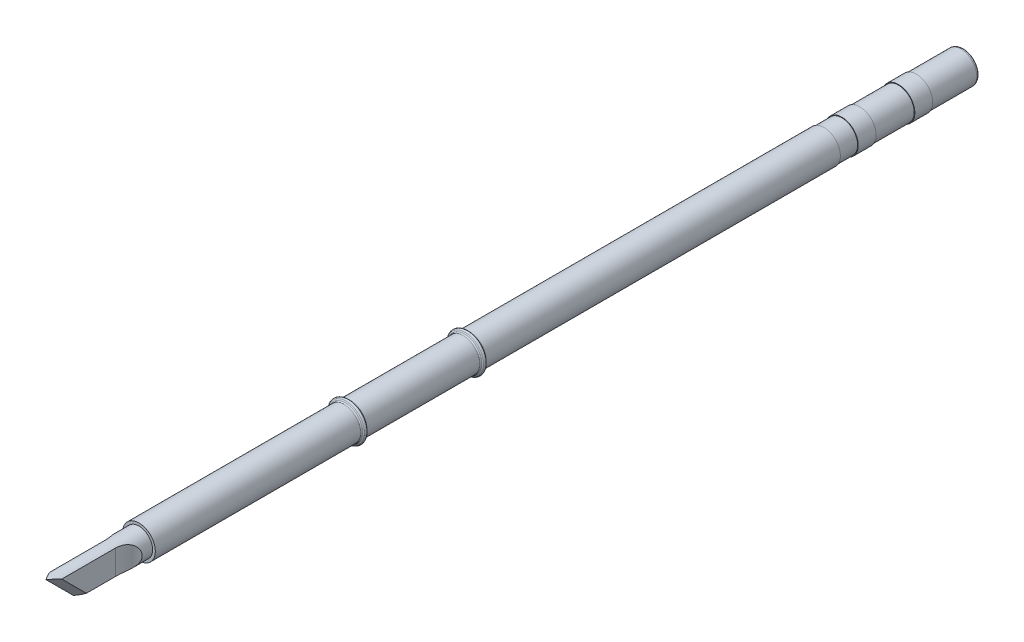
ISO-10303-21;
HEADER;
FILE_DESCRIPTION(('STEP AP214'),'2;1');
FILE_NAME('part.step','',(''),(''),'','','');
FILE_SCHEMA(('AUTOMOTIVE_DESIGN { 1 0 10303 214 1 1 1 1 }'));
ENDSEC;
DATA;
#1=APPLICATION_CONTEXT('core data for automotive mechanical design processes');
#2=APPLICATION_PROTOCOL_DEFINITION('international standard','automotive_design',2000,#1);
#3=PRODUCT_CONTEXT('',#1,'mechanical');
#4=PRODUCT('Part','Part','',(#3));
#5=PRODUCT_RELATED_PRODUCT_CATEGORY('part','',(#4));
#6=PRODUCT_DEFINITION_FORMATION('','',#4);
#7=PRODUCT_DEFINITION_CONTEXT('part definition',#1,'design');
#8=PRODUCT_DEFINITION('design','',#6,#7);
#9=PRODUCT_DEFINITION_SHAPE('','',#8);
#10=(LENGTH_UNIT() NAMED_UNIT(*) SI_UNIT(.MILLI.,.METRE.));
#11=(NAMED_UNIT(*) PLANE_ANGLE_UNIT() SI_UNIT($,.RADIAN.));
#12=(NAMED_UNIT(*) SI_UNIT($,.STERADIAN.) SOLID_ANGLE_UNIT());
#13=UNCERTAINTY_MEASURE_WITH_UNIT(LENGTH_MEASURE(1.E-05),#10,'distance_accuracy_value','');
#14=(GEOMETRIC_REPRESENTATION_CONTEXT(3) GLOBAL_UNCERTAINTY_ASSIGNED_CONTEXT((#13)) GLOBAL_UNIT_ASSIGNED_CONTEXT((#10,
#11,#12)) REPRESENTATION_CONTEXT('',''));
#15=CARTESIAN_POINT('',(0.,0.,0.));
#16=DIRECTION('',(0.,0.,1.));
#17=DIRECTION('',(1.,0.,0.));
#18=AXIS2_PLACEMENT_3D('',#15,#16,#17);
#19=CARTESIAN_POINT('',(0.,0.,-0.545183370351595));
#20=DIRECTION('',(0.,0.,-1.));
#21=DIRECTION('',(-1.,0.,0.));
#22=AXIS2_PLACEMENT_3D('',#19,#20,#21);
#23=TOROIDAL_SURFACE('',#22,3.,0.25);
#24=CARTESIAN_POINT('',(0.,0.,-0.545183370351596));
#25=DIRECTION('',(0.,0.,-1.));
#26=DIRECTION('',(-1.,0.,0.));
#27=AXIS2_PLACEMENT_3D('',#24,#25,#26);
#28=CIRCLE('',#27,2.75);
#29=CARTESIAN_POINT('',(-2.75,0.,-0.545183370351594));
#30=VERTEX_POINT('',#29);
#31=EDGE_CURVE('E216',#30,#30,#28,.T.);
#32=ORIENTED_EDGE('',*,*,#31,.F.);
#33=EDGE_LOOP('',(#32));
#34=FACE_BOUND('',#33,.T.);
#35=CARTESIAN_POINT('',(0.,0.,-0.328046378891428));
#36=DIRECTION('',(0.,0.,-1.));
#37=DIRECTION('',(-1.,0.,0.));
#38=AXIS2_PLACEMENT_3D('',#35,#36,#37);
#39=CIRCLE('',#38,2.87609872099277);
#40=CARTESIAN_POINT('',(-2.87609872099277,0.,-0.328046378891428));
#41=VERTEX_POINT('',#40);
#42=EDGE_CURVE('E116',#41,#41,#39,.T.);
#43=ORIENTED_EDGE('',*,*,#42,.T.);
#44=EDGE_LOOP('',(#43));
#45=FACE_BOUND('',#44,.T.);
#46=ADVANCED_FACE('F16',(#34,#45),#23,.F.);
#47=CARTESIAN_POINT('',(0.,0.,0.545183370351595));
#48=DIRECTION('',(0.,0.,-1.));
#49=DIRECTION('',(-1.,0.,0.));
#50=AXIS2_PLACEMENT_3D('',#47,#48,#49);
#51=TOROIDAL_SURFACE('',#50,3.,0.25);
#52=CARTESIAN_POINT('',(0.,0.,0.545183370351594));
#53=DIRECTION('',(0.,0.,-1.));
#54=DIRECTION('',(-1.,0.,0.));
#55=AXIS2_PLACEMENT_3D('',#52,#53,#54);
#56=CIRCLE('',#55,2.75);
#57=CARTESIAN_POINT('',(-2.75,0.,0.545183370351594));
#58=VERTEX_POINT('',#57);
#59=EDGE_CURVE('E210',#58,#58,#56,.T.);
#60=ORIENTED_EDGE('',*,*,#59,.T.);
#61=EDGE_LOOP('',(#60));
#62=FACE_BOUND('',#61,.T.);
#63=CARTESIAN_POINT('',(0.,0.,0.328046378891427));
#64=DIRECTION('',(0.,0.,-1.));
#65=DIRECTION('',(-1.,0.,0.));
#66=AXIS2_PLACEMENT_3D('',#63,#64,#65);
#67=CIRCLE('',#66,2.87609872099277);
#68=CARTESIAN_POINT('',(-2.87609872099277,0.,0.328046378891427));
#69=VERTEX_POINT('',#68);
#70=EDGE_CURVE('E268',#69,#69,#67,.T.);
#71=ORIENTED_EDGE('',*,*,#70,.F.);
#72=EDGE_LOOP('',(#71));
#73=FACE_BOUND('',#72,.T.);
#74=ADVANCED_FACE('F334',(#62,#73),#51,.F.);
#75=CARTESIAN_POINT('',(0.,0.,19.4548166296484));
#76=DIRECTION('',(0.,0.,-1.));
#77=DIRECTION('',(-1.,0.,0.));
#78=AXIS2_PLACEMENT_3D('',#75,#76,#77);
#79=TOROIDAL_SURFACE('',#78,3.,0.25);
#80=CARTESIAN_POINT('',(0.,0.,19.4548166296484));
#81=DIRECTION('',(0.,0.,-1.));
#82=DIRECTION('',(-1.,0.,0.));
#83=AXIS2_PLACEMENT_3D('',#80,#81,#82);
#84=CIRCLE('',#83,2.75);
#85=CARTESIAN_POINT('',(-2.75,0.,19.4548166296484));
#86=VERTEX_POINT('',#85);
#87=EDGE_CURVE('E214',#86,#86,#84,.T.);
#88=ORIENTED_EDGE('',*,*,#87,.F.);
#89=EDGE_LOOP('',(#88));
#90=FACE_BOUND('',#89,.T.);
#91=CARTESIAN_POINT('',(0.,0.,19.6719536211086));
#92=DIRECTION('',(0.,0.,-1.));
#93=DIRECTION('',(-1.,0.,0.));
#94=AXIS2_PLACEMENT_3D('',#91,#92,#93);
#95=CIRCLE('',#94,2.87609872099277);
#96=CARTESIAN_POINT('',(-2.87609872099277,0.,19.6719536211086));
#97=VERTEX_POINT('',#96);
#98=EDGE_CURVE('E215',#97,#97,#95,.T.);
#99=ORIENTED_EDGE('',*,*,#98,.T.);
#100=EDGE_LOOP('',(#99));
#101=FACE_BOUND('',#100,.T.);
#102=ADVANCED_FACE('F340',(#90,#101),#79,.F.);
#103=CARTESIAN_POINT('',(0.,0.,20.5451833703516));
#104=DIRECTION('',(0.,0.,-1.));
#105=DIRECTION('',(-1.,0.,0.));
#106=AXIS2_PLACEMENT_3D('',#103,#104,#105);
#107=TOROIDAL_SURFACE('',#106,3.,0.25);
#108=CARTESIAN_POINT('',(0.,0.,20.5451833703516));
#109=DIRECTION('',(0.,0.,-1.));
#110=DIRECTION('',(-1.,0.,0.));
#111=AXIS2_PLACEMENT_3D('',#108,#109,#110);
#112=CIRCLE('',#111,2.75);
#113=CARTESIAN_POINT('',(-2.75,0.,20.5451833703516));
#114=VERTEX_POINT('',#113);
#115=EDGE_CURVE('E193',#114,#114,#112,.T.);
#116=ORIENTED_EDGE('',*,*,#115,.T.);
#117=EDGE_LOOP('',(#116));
#118=FACE_BOUND('',#117,.T.);
#119=CARTESIAN_POINT('',(0.,0.,20.3280463788914));
#120=DIRECTION('',(0.,0.,-1.));
#121=DIRECTION('',(-1.,0.,0.));
#122=AXIS2_PLACEMENT_3D('',#119,#120,#121);
#123=CIRCLE('',#122,2.87609872099277);
#124=CARTESIAN_POINT('',(-2.87609872099277,0.,20.3280463788914));
#125=VERTEX_POINT('',#124);
#126=EDGE_CURVE('E192',#125,#125,#123,.T.);
#127=ORIENTED_EDGE('',*,*,#126,.F.);
#128=EDGE_LOOP('',(#127));
#129=FACE_BOUND('',#128,.T.);
#130=ADVANCED_FACE('F364',(#118,#129),#107,.F.);
#131=CARTESIAN_POINT('',(0.,0.,0.));
#132=DIRECTION('',(0.,0.,-1.));
#133=DIRECTION('',(-1.,0.,0.));
#134=AXIS2_PLACEMENT_3D('',#131,#132,#133);
#135=TOROIDAL_SURFACE('',#134,2.94656614345883,0.25);
#136=CARTESIAN_POINT('',(0.,0.,0.217136991460167));
#137=DIRECTION('',(0.,0.,-1.));
#138=DIRECTION('',(-1.,0.,0.));
#139=AXIS2_PLACEMENT_3D('',#136,#137,#138);
#140=CIRCLE('',#139,3.07046742246606);
#141=CARTESIAN_POINT('',(-3.07046742246605,0.,0.217136991460167));
#142=VERTEX_POINT('',#141);
#143=EDGE_CURVE('E233',#142,#142,#140,.T.);
#144=ORIENTED_EDGE('',*,*,#143,.T.);
#145=EDGE_LOOP('',(#144));
#146=FACE_BOUND('',#145,.T.);
#147=CARTESIAN_POINT('',(0.,0.,-0.217136991460168));
#148=DIRECTION('',(0.,0.,-1.));
#149=DIRECTION('',(-1.,0.,0.));
#150=AXIS2_PLACEMENT_3D('',#147,#148,#149);
#151=CIRCLE('',#150,3.07046742246606);
#152=CARTESIAN_POINT('',(-3.07046742246605,0.,-0.217136991460169));
#153=VERTEX_POINT('',#152);
#154=EDGE_CURVE('E245',#153,#153,#151,.T.);
#155=ORIENTED_EDGE('',*,*,#154,.F.);
#156=EDGE_LOOP('',(#155));
#157=FACE_BOUND('',#156,.T.);
#158=ADVANCED_FACE('F414',(#146,#157),#135,.T.);
#159=CARTESIAN_POINT('',(0.,0.,20.));
#160=DIRECTION('',(0.,0.,-1.));
#161=DIRECTION('',(-1.,0.,0.));
#162=AXIS2_PLACEMENT_3D('',#159,#160,#161);
#163=TOROIDAL_SURFACE('',#162,2.94656614345883,0.25);
#164=CARTESIAN_POINT('',(0.,0.,20.2171369914602));
#165=DIRECTION('',(0.,0.,-1.));
#166=DIRECTION('',(-1.,0.,0.));
#167=AXIS2_PLACEMENT_3D('',#164,#165,#166);
#168=CIRCLE('',#167,3.07046742246605);
#169=CARTESIAN_POINT('',(-3.07046742246606,0.,20.2171369914602));
#170=VERTEX_POINT('',#169);
#171=EDGE_CURVE('E187',#170,#170,#168,.T.);
#172=ORIENTED_EDGE('',*,*,#171,.T.);
#173=EDGE_LOOP('',(#172));
#174=FACE_BOUND('',#173,.T.);
#175=CARTESIAN_POINT('',(0.,0.,19.7828630085398));
#176=DIRECTION('',(0.,0.,-1.));
#177=DIRECTION('',(-1.,0.,0.));
#178=AXIS2_PLACEMENT_3D('',#175,#176,#177);
#179=CIRCLE('',#178,3.07046742246605);
#180=CARTESIAN_POINT('',(-3.07046742246606,0.,19.7828630085398));
#181=VERTEX_POINT('',#180);
#182=EDGE_CURVE('E200',#181,#181,#179,.T.);
#183=ORIENTED_EDGE('',*,*,#182,.F.);
#184=EDGE_LOOP('',(#183));
#185=FACE_BOUND('',#184,.T.);
#186=ADVANCED_FACE('F188',(#174,#185),#163,.T.);
#187=CARTESIAN_POINT('',(0.,0.,-83.));
#188=DIRECTION('',(0.,0.,-1.));
#189=DIRECTION('',(-1.,0.,0.));
#190=AXIS2_PLACEMENT_3D('',#187,#188,#189);
#191=TOROIDAL_SURFACE('',#190,2.15,0.5);
#192=CARTESIAN_POINT('',(0.,0.,-83.5));
#193=DIRECTION('',(0.,0.,-1.));
#194=DIRECTION('',(-1.,0.,0.));
#195=AXIS2_PLACEMENT_3D('',#192,#193,#194);
#196=CIRCLE('',#195,2.15);
#197=CARTESIAN_POINT('',(-2.15,0.,-83.5));
#198=VERTEX_POINT('',#197);
#199=EDGE_CURVE('E27',#198,#198,#196,.T.);
#200=ORIENTED_EDGE('',*,*,#199,.F.);
#201=EDGE_LOOP('',(#200));
#202=FACE_BOUND('',#201,.T.);
#203=CARTESIAN_POINT('',(0.,0.,-83.));
#204=DIRECTION('',(0.,0.,-1.));
#205=DIRECTION('',(-1.,0.,0.));
#206=AXIS2_PLACEMENT_3D('',#203,#204,#205);
#207=CIRCLE('',#206,2.65);
#208=CARTESIAN_POINT('',(-2.65,0.,-83.));
#209=VERTEX_POINT('',#208);
#210=EDGE_CURVE('E223',#209,#209,#207,.T.);
#211=ORIENTED_EDGE('',*,*,#210,.T.);
#212=EDGE_LOOP('',(#211));
#213=FACE_BOUND('',#212,.T.);
#214=ADVANCED_FACE('F313',(#202,#213),#191,.T.);
#215=CARTESIAN_POINT('',(-1.,-4.19255186128045,62.6932345763465));
#216=DIRECTION('',(0.707106781186547,0.5,-0.5));
#217=DIRECTION('',(0.,-0.707106781186549,-0.707106781186546));
#218=AXIS2_PLACEMENT_3D('',#215,#216,#217);
#219=PLANE('',#218);
#220=DIRECTION('',(0.,0.707106781186549,0.707106781186546));
#221=VECTOR('',#220,1.);
#222=CARTESIAN_POINT('',(-1.,-2.0712315177208,64.8145549199061));
#223=LINE('',#222,#221);
#224=CARTESIAN_POINT('',(-1.,-2.0712315177208,64.8145549199061));
#225=VERTEX_POINT('',#224);
#226=CARTESIAN_POINT('',(-1.,2.07123151772079,68.9570179553477));
#227=VERTEX_POINT('',#226);
#228=EDGE_CURVE('E229',#225,#227,#223,.T.);
#229=ORIENTED_EDGE('',*,*,#228,.F.);
#230=CARTESIAN_POINT('',(-1.,-2.0712315177208,64.8145549199061));
#231=CARTESIAN_POINT('',(-0.686808648763807,-2.2224417269884,65.1062641671747));
#232=CARTESIAN_POINT('',(-0.347783481315479,-2.3,65.5081598839543));
#233=CARTESIAN_POINT('',(0.,-2.3,66.));
#234=(BOUNDED_CURVE() B_SPLINE_CURVE(3,(#230,#231,#232,#233),.UNSPECIFIED.,.F.,
.F.) B_SPLINE_CURVE_WITH_KNOTS((4,4),(-1.,0.),
.UNSPECIFIED.) CURVE() GEOMETRIC_REPRESENTATION_ITEM() RATIONAL_B_SPLINE_CURVE((1.,
0.983211175271049,0.983211175271049,1.)) REPRESENTATION_ITEM(''));
#235=CARTESIAN_POINT('',(0.,-2.3,66.));
#236=VERTEX_POINT('',#235);
#237=EDGE_CURVE('E298',#225,#236,#234,.T.);
#238=ORIENTED_EDGE('',*,*,#237,.T.);
#239=DIRECTION('',(0.,-0.707106781186548,-0.707106781186547));
#240=VECTOR('',#239,1.);
#241=CARTESIAN_POINT('',(0.,2.3,70.6));
#242=LINE('',#241,#240);
#243=CARTESIAN_POINT('',(0.,2.3,70.6));
#244=VERTEX_POINT('',#243);
#245=EDGE_CURVE('E11',#244,#236,#242,.T.);
#246=ORIENTED_EDGE('',*,*,#245,.F.);
#247=CARTESIAN_POINT('',(0.,2.3,70.6));
#248=CARTESIAN_POINT('',(-0.347783481315481,2.3,70.1081598839543));
#249=CARTESIAN_POINT('',(-0.686808648763809,2.22244172698839,69.5511476211515));
#250=CARTESIAN_POINT('',(-1.,2.07123151772079,68.9570179553477));
#251=(BOUNDED_CURVE() B_SPLINE_CURVE(3,(#247,#248,#249,#250),.UNSPECIFIED.,.F.,
.F.) B_SPLINE_CURVE_WITH_KNOTS((4,4),(-1.,0.),
.UNSPECIFIED.) CURVE() GEOMETRIC_REPRESENTATION_ITEM() RATIONAL_B_SPLINE_CURVE((1.,
0.983211175271049,0.983211175271049,1.)) REPRESENTATION_ITEM(''));
#252=EDGE_CURVE('E239',#244,#227,#251,.T.);
#253=ORIENTED_EDGE('',*,*,#252,.T.);
#254=EDGE_LOOP('',(#229,#238,#246,#253));
#255=FACE_BOUND('',#254,.T.);
#256=ADVANCED_FACE('F426',(#255),#219,.F.);
#257=CARTESIAN_POINT('',(0.999999999999988,5.60676542365356,72.4925518612805));
#258=DIRECTION('',(-0.707106781186545,0.5,-0.5));
#259=DIRECTION('',(-0.577350269189629,0.,0.816496580927724));
#260=AXIS2_PLACEMENT_3D('',#257,#258,#259);
#261=PLANE('',#260);
#262=DIRECTION('',(0.,-0.707106781186547,-0.707106781186549));
#263=VECTOR('',#262,1.);
#264=CARTESIAN_POINT('',(0.999999999999988,2.07123151772079,68.9570179553477));
#265=LINE('',#264,#263);
#266=CARTESIAN_POINT('',(0.999999999999988,2.07123151772079,68.9570179553477));
#267=VERTEX_POINT('',#266);
#268=CARTESIAN_POINT('',(0.999999999999988,-2.0712315177208,64.8145549199061));
#269=VERTEX_POINT('',#268);
#270=EDGE_CURVE('E290',#267,#269,#265,.T.);
#271=ORIENTED_EDGE('',*,*,#270,.F.);
#272=CARTESIAN_POINT('',(0.999999999999989,2.07123151772079,68.9570179553477));
#273=CARTESIAN_POINT('',(0.686808648763787,2.22244172698839,69.5511476211515));
#274=CARTESIAN_POINT('',(0.347783481315461,2.3,70.1081598839543));
#275=CARTESIAN_POINT('',(0.,2.3,70.6));
#276=(BOUNDED_CURVE() B_SPLINE_CURVE(3,(#272,#273,#274,#275),.UNSPECIFIED.,.F.,
.F.) B_SPLINE_CURVE_WITH_KNOTS((4,4),(0.,1.),
.UNSPECIFIED.) CURVE() GEOMETRIC_REPRESENTATION_ITEM() RATIONAL_B_SPLINE_CURVE((1.,
0.983211175271049,0.983211175271049,1.)) REPRESENTATION_ITEM(''));
#277=EDGE_CURVE('E234',#267,#244,#276,.T.);
#278=ORIENTED_EDGE('',*,*,#277,.T.);
#279=ORIENTED_EDGE('',*,*,#245,.T.);
#280=CARTESIAN_POINT('',(0.,-2.3,66.));
#281=CARTESIAN_POINT('',(0.347783481315458,-2.3,65.5081598839543));
#282=CARTESIAN_POINT('',(0.686808648763784,-2.2224417269884,65.1062641671747));
#283=CARTESIAN_POINT('',(0.999999999999986,-2.0712315177208,64.8145549199061));
#284=(BOUNDED_CURVE() B_SPLINE_CURVE(3,(#280,#281,#282,#283),.UNSPECIFIED.,.F.,
.F.) B_SPLINE_CURVE_WITH_KNOTS((4,4),(0.,1.),
.UNSPECIFIED.) CURVE() GEOMETRIC_REPRESENTATION_ITEM() RATIONAL_B_SPLINE_CURVE((1.,
0.983211175271049,0.983211175271049,1.)) REPRESENTATION_ITEM(''));
#285=EDGE_CURVE('E440',#236,#269,#284,.T.);
#286=ORIENTED_EDGE('',*,*,#285,.T.);
#287=EDGE_LOOP('',(#271,#278,#279,#286));
#288=FACE_BOUND('',#287,.T.);
#289=ADVANCED_FACE('F329',(#288),#261,.F.);
#290=CARTESIAN_POINT('',(0.,0.,-83.5));
#291=DIRECTION('',(0.,0.,-1.));
#292=DIRECTION('',(0.,-1.,0.));
#293=AXIS2_PLACEMENT_3D('',#290,#291,#292);
#294=PLANE('',#293);
#295=ORIENTED_EDGE('',*,*,#199,.T.);
#296=EDGE_LOOP('',(#295));
#297=FACE_BOUND('',#296,.T.);
#298=ADVANCED_FACE('F318',(#297),#294,.T.);
#299=CARTESIAN_POINT('',(0.,0.,-75.5));
#300=DIRECTION('',(0.,0.,-1.));
#301=DIRECTION('',(-1.,0.,0.));
#302=AXIS2_PLACEMENT_3D('',#299,#300,#301);
#303=CYLINDRICAL_SURFACE('',#302,2.65);
#304=CARTESIAN_POINT('',(0.,0.,-75.5));
#305=DIRECTION('',(0.,0.,-1.));
#306=DIRECTION('',(-1.,0.,0.));
#307=AXIS2_PLACEMENT_3D('',#304,#305,#306);
#308=CIRCLE('',#307,2.65);
#309=CARTESIAN_POINT('',(-2.65,0.,-75.5));
#310=VERTEX_POINT('',#309);
#311=EDGE_CURVE('E220',#310,#310,#308,.T.);
#312=ORIENTED_EDGE('',*,*,#311,.T.);
#313=EDGE_LOOP('',(#312));
#314=FACE_BOUND('',#313,.T.);
#315=ORIENTED_EDGE('',*,*,#210,.F.);
#316=EDGE_LOOP('',(#315));
#317=FACE_BOUND('',#316,.T.);
#318=ADVANCED_FACE('F315',(#314,#317),#303,.T.);
#319=CARTESIAN_POINT('',(0.,0.,-75.5));
#320=DIRECTION('',(0.,0.,-1.));
#321=DIRECTION('',(0.,-1.,0.));
#322=AXIS2_PLACEMENT_3D('',#319,#320,#321);
#323=PLANE('',#322);
#324=ORIENTED_EDGE('',*,*,#311,.F.);
#325=EDGE_LOOP('',(#324));
#326=FACE_BOUND('',#325,.T.);
#327=CARTESIAN_POINT('',(0.,0.,-75.5));
#328=DIRECTION('',(0.,0.,-1.));
#329=DIRECTION('',(-1.,0.,0.));
#330=AXIS2_PLACEMENT_3D('',#327,#328,#329);
#331=CIRCLE('',#330,2.75);
#332=CARTESIAN_POINT('',(-2.75,0.,-75.5));
#333=VERTEX_POINT('',#332);
#334=EDGE_CURVE('E224',#333,#333,#331,.T.);
#335=ORIENTED_EDGE('',*,*,#334,.T.);
#336=EDGE_LOOP('',(#335));
#337=FACE_BOUND('',#336,.T.);
#338=ADVANCED_FACE('F317',(#326,#337),#323,.T.);
#339=CARTESIAN_POINT('',(0.,0.,-72.5));
#340=DIRECTION('',(0.,0.,-1.));
#341=DIRECTION('',(-1.,0.,0.));
#342=AXIS2_PLACEMENT_3D('',#339,#340,#341);
#343=CYLINDRICAL_SURFACE('',#342,2.75);
#344=CARTESIAN_POINT('',(0.,0.,-72.5));
#345=DIRECTION('',(0.,0.,-1.));
#346=DIRECTION('',(-1.,0.,0.));
#347=AXIS2_PLACEMENT_3D('',#344,#345,#346);
#348=CIRCLE('',#347,2.75);
#349=CARTESIAN_POINT('',(-2.75,0.,-72.5));
#350=VERTEX_POINT('',#349);
#351=EDGE_CURVE('E259',#350,#350,#348,.T.);
#352=ORIENTED_EDGE('',*,*,#351,.T.);
#353=EDGE_LOOP('',(#352));
#354=FACE_BOUND('',#353,.T.);
#355=ORIENTED_EDGE('',*,*,#334,.F.);
#356=EDGE_LOOP('',(#355));
#357=FACE_BOUND('',#356,.T.);
#358=ADVANCED_FACE('F326',(#354,#357),#343,.T.);
#359=CARTESIAN_POINT('',(0.,0.,-72.5));
#360=DIRECTION('',(0.,0.,1.));
#361=DIRECTION('',(1.,0.,0.));
#362=AXIS2_PLACEMENT_3D('',#359,#360,#361);
#363=PLANE('',#362);
#364=CARTESIAN_POINT('',(0.,0.,-72.5));
#365=DIRECTION('',(0.,0.,-1.));
#366=DIRECTION('',(-1.,0.,0.));
#367=AXIS2_PLACEMENT_3D('',#364,#365,#366);
#368=CIRCLE('',#367,2.65);
#369=CARTESIAN_POINT('',(-2.65,0.,-72.5));
#370=VERTEX_POINT('',#369);
#371=EDGE_CURVE('E256',#370,#370,#368,.T.);
#372=ORIENTED_EDGE('',*,*,#371,.T.);
#373=EDGE_LOOP('',(#372));
#374=FACE_BOUND('',#373,.T.);
#375=ORIENTED_EDGE('',*,*,#351,.F.);
#376=EDGE_LOOP('',(#375));
#377=FACE_BOUND('',#376,.T.);
#378=ADVANCED_FACE('F18',(#374,#377),#363,.T.);
#379=CARTESIAN_POINT('',(0.,0.,-66.));
#380=DIRECTION('',(0.,0.,-1.));
#381=DIRECTION('',(-1.,0.,0.));
#382=AXIS2_PLACEMENT_3D('',#379,#380,#381);
#383=CYLINDRICAL_SURFACE('',#382,2.65);
#384=CARTESIAN_POINT('',(0.,0.,-66.));
#385=DIRECTION('',(0.,0.,-1.));
#386=DIRECTION('',(-1.,0.,0.));
#387=AXIS2_PLACEMENT_3D('',#384,#385,#386);
#388=CIRCLE('',#387,2.65);
#389=CARTESIAN_POINT('',(-2.65,0.,-66.));
#390=VERTEX_POINT('',#389);
#391=EDGE_CURVE('E255',#390,#390,#388,.T.);
#392=ORIENTED_EDGE('',*,*,#391,.T.);
#393=EDGE_LOOP('',(#392));
#394=FACE_BOUND('',#393,.T.);
#395=ORIENTED_EDGE('',*,*,#371,.F.);
#396=EDGE_LOOP('',(#395));
#397=FACE_BOUND('',#396,.T.);
#398=ADVANCED_FACE('F369',(#394,#397),#383,.T.);
#399=CARTESIAN_POINT('',(0.,0.,-66.));
#400=DIRECTION('',(0.,0.,-1.));
#401=DIRECTION('',(0.,-1.,0.));
#402=AXIS2_PLACEMENT_3D('',#399,#400,#401);
#403=PLANE('',#402);
#404=ORIENTED_EDGE('',*,*,#391,.F.);
#405=EDGE_LOOP('',(#404));
#406=FACE_BOUND('',#405,.T.);
#407=CARTESIAN_POINT('',(0.,0.,-66.));
#408=DIRECTION('',(0.,0.,-1.));
#409=DIRECTION('',(-1.,0.,0.));
#410=AXIS2_PLACEMENT_3D('',#407,#408,#409);
#411=CIRCLE('',#410,2.75);
#412=CARTESIAN_POINT('',(-2.75,0.,-66.));
#413=VERTEX_POINT('',#412);
#414=EDGE_CURVE('E251',#413,#413,#411,.T.);
#415=ORIENTED_EDGE('',*,*,#414,.T.);
#416=EDGE_LOOP('',(#415));
#417=FACE_BOUND('',#416,.T.);
#418=ADVANCED_FACE('F355',(#406,#417),#403,.T.);
#419=CARTESIAN_POINT('',(0.,0.,-63.));
#420=DIRECTION('',(0.,0.,-1.));
#421=DIRECTION('',(-1.,0.,0.));
#422=AXIS2_PLACEMENT_3D('',#419,#420,#421);
#423=CYLINDRICAL_SURFACE('',#422,2.75);
#424=CARTESIAN_POINT('',(0.,0.,-63.));
#425=DIRECTION('',(0.,0.,-1.));
#426=DIRECTION('',(-1.,0.,0.));
#427=AXIS2_PLACEMENT_3D('',#424,#425,#426);
#428=CIRCLE('',#427,2.75);
#429=CARTESIAN_POINT('',(-2.75,0.,-63.));
#430=VERTEX_POINT('',#429);
#431=EDGE_CURVE('E20',#430,#430,#428,.T.);
#432=ORIENTED_EDGE('',*,*,#431,.T.);
#433=EDGE_LOOP('',(#432));
#434=FACE_BOUND('',#433,.T.);
#435=ORIENTED_EDGE('',*,*,#414,.F.);
#436=EDGE_LOOP('',(#435));
#437=FACE_BOUND('',#436,.T.);
#438=ADVANCED_FACE('F352',(#434,#437),#423,.T.);
#439=CARTESIAN_POINT('',(0.,0.,-63.));
#440=DIRECTION('',(0.,0.,1.));
#441=DIRECTION('',(1.,0.,0.));
#442=AXIS2_PLACEMENT_3D('',#439,#440,#441);
#443=PLANE('',#442);
#444=CARTESIAN_POINT('',(0.,0.,-63.));
#445=DIRECTION('',(0.,0.,-1.));
#446=DIRECTION('',(-1.,0.,0.));
#447=AXIS2_PLACEMENT_3D('',#444,#445,#446);
#448=CIRCLE('',#447,2.65);
#449=CARTESIAN_POINT('',(-2.65,0.,-63.));
#450=VERTEX_POINT('',#449);
#451=EDGE_CURVE('E273',#450,#450,#448,.T.);
#452=ORIENTED_EDGE('',*,*,#451,.T.);
#453=EDGE_LOOP('',(#452));
#454=FACE_BOUND('',#453,.T.);
#455=ORIENTED_EDGE('',*,*,#431,.F.);
#456=EDGE_LOOP('',(#455));
#457=FACE_BOUND('',#456,.T.);
#458=ADVANCED_FACE('F348',(#454,#457),#443,.T.);
#459=CARTESIAN_POINT('',(0.,0.,-60.));
#460=DIRECTION('',(0.,0.,-1.));
#461=DIRECTION('',(-1.,0.,0.));
#462=AXIS2_PLACEMENT_3D('',#459,#460,#461);
#463=CYLINDRICAL_SURFACE('',#462,2.65);
#464=CARTESIAN_POINT('',(0.,0.,-60.));
#465=DIRECTION('',(0.,0.,-1.));
#466=DIRECTION('',(-1.,0.,0.));
#467=AXIS2_PLACEMENT_3D('',#464,#465,#466);
#468=CIRCLE('',#467,2.65);
#469=CARTESIAN_POINT('',(-2.65,0.,-60.));
#470=VERTEX_POINT('',#469);
#471=EDGE_CURVE('E219',#470,#470,#468,.T.);
#472=ORIENTED_EDGE('',*,*,#471,.T.);
#473=EDGE_LOOP('',(#472));
#474=FACE_BOUND('',#473,.T.);
#475=ORIENTED_EDGE('',*,*,#451,.F.);
#476=EDGE_LOOP('',(#475));
#477=FACE_BOUND('',#476,.T.);
#478=ADVANCED_FACE('F351',(#474,#477),#463,.T.);
#479=CARTESIAN_POINT('',(0.,0.,-60.));
#480=DIRECTION('',(0.,0.,-1.));
#481=DIRECTION('',(0.,-1.,0.));
#482=AXIS2_PLACEMENT_3D('',#479,#480,#481);
#483=PLANE('',#482);
#484=ORIENTED_EDGE('',*,*,#471,.F.);
#485=EDGE_LOOP('',(#484));
#486=FACE_BOUND('',#485,.T.);
#487=CARTESIAN_POINT('',(0.,0.,-60.));
#488=DIRECTION('',(0.,0.,-1.));
#489=DIRECTION('',(-1.,0.,0.));
#490=AXIS2_PLACEMENT_3D('',#487,#488,#489);
#491=CIRCLE('',#490,2.75);
#492=CARTESIAN_POINT('',(-2.75,0.,-60.));
#493=VERTEX_POINT('',#492);
#494=EDGE_CURVE('E103',#493,#493,#491,.T.);
#495=ORIENTED_EDGE('',*,*,#494,.T.);
#496=EDGE_LOOP('',(#495));
#497=FACE_BOUND('',#496,.T.);
#498=ADVANCED_FACE('F379',(#486,#497),#483,.T.);
#499=CARTESIAN_POINT('',(0.,0.,-0.4));
#500=DIRECTION('',(0.,0.,-1.));
#501=DIRECTION('',(-1.,0.,0.));
#502=AXIS2_PLACEMENT_3D('',#499,#500,#501);
#503=CYLINDRICAL_SURFACE('',#502,2.75);
#504=ORIENTED_EDGE('',*,*,#31,.T.);
#505=EDGE_LOOP('',(#504));
#506=FACE_BOUND('',#505,.T.);
#507=ORIENTED_EDGE('',*,*,#494,.F.);
#508=EDGE_LOOP('',(#507));
#509=FACE_BOUND('',#508,.T.);
#510=ADVANCED_FACE('F385',(#506,#509),#503,.T.);
#511=CARTESIAN_POINT('',(0.,0.,-0.272591685175798));
#512=DIRECTION('',(0.,0.,1.));
#513=DIRECTION('',(1.,0.,0.));
#514=AXIS2_PLACEMENT_3D('',#511,#512,#513);
#515=CONICAL_SURFACE('',#514,2.97328307172941,1.05226493507737);
#516=ORIENTED_EDGE('',*,*,#42,.F.);
#517=EDGE_LOOP('',(#516));
#518=FACE_BOUND('',#517,.T.);
#519=ORIENTED_EDGE('',*,*,#154,.T.);
#520=EDGE_LOOP('',(#519));
#521=FACE_BOUND('',#520,.T.);
#522=ADVANCED_FACE('F387',(#518,#521),#515,.T.);
#523=CARTESIAN_POINT('',(0.,0.,0.272591685175797));
#524=DIRECTION('',(0.,0.,-1.));
#525=DIRECTION('',(-1.,0.,0.));
#526=AXIS2_PLACEMENT_3D('',#523,#524,#525);
#527=CONICAL_SURFACE('',#526,2.97328307172941,1.05226493507737);
#528=ORIENTED_EDGE('',*,*,#70,.T.);
#529=EDGE_LOOP('',(#528));
#530=FACE_BOUND('',#529,.T.);
#531=ORIENTED_EDGE('',*,*,#143,.F.);
#532=EDGE_LOOP('',(#531));
#533=FACE_BOUND('',#532,.T.);
#534=ADVANCED_FACE('F383',(#530,#533),#527,.T.);
#535=CARTESIAN_POINT('',(0.,0.,19.6));
#536=DIRECTION('',(0.,0.,-1.));
#537=DIRECTION('',(-1.,0.,0.));
#538=AXIS2_PLACEMENT_3D('',#535,#536,#537);
#539=CYLINDRICAL_SURFACE('',#538,2.75);
#540=ORIENTED_EDGE('',*,*,#87,.T.);
#541=EDGE_LOOP('',(#540));
#542=FACE_BOUND('',#541,.T.);
#543=ORIENTED_EDGE('',*,*,#59,.F.);
#544=EDGE_LOOP('',(#543));
#545=FACE_BOUND('',#544,.T.);
#546=ADVANCED_FACE('F381',(#542,#545),#539,.T.);
#547=CARTESIAN_POINT('',(0.,0.,19.7274083148242));
#548=DIRECTION('',(0.,0.,1.));
#549=DIRECTION('',(1.,0.,0.));
#550=AXIS2_PLACEMENT_3D('',#547,#548,#549);
#551=CONICAL_SURFACE('',#550,2.97328307172941,1.05226493507737);
#552=ORIENTED_EDGE('',*,*,#98,.F.);
#553=EDGE_LOOP('',(#552));
#554=FACE_BOUND('',#553,.T.);
#555=ORIENTED_EDGE('',*,*,#182,.T.);
#556=EDGE_LOOP('',(#555));
#557=FACE_BOUND('',#556,.T.);
#558=ADVANCED_FACE('F375',(#554,#557),#551,.T.);
#559=CARTESIAN_POINT('',(0.,0.,20.2725916851758));
#560=DIRECTION('',(0.,0.,-1.));
#561=DIRECTION('',(-1.,0.,0.));
#562=AXIS2_PLACEMENT_3D('',#559,#560,#561);
#563=CONICAL_SURFACE('',#562,2.97328307172941,1.05226493507737);
#564=ORIENTED_EDGE('',*,*,#126,.T.);
#565=EDGE_LOOP('',(#564));
#566=FACE_BOUND('',#565,.T.);
#567=ORIENTED_EDGE('',*,*,#171,.F.);
#568=EDGE_LOOP('',(#567));
#569=FACE_BOUND('',#568,.T.);
#570=ADVANCED_FACE('F371',(#566,#569),#563,.T.);
#571=CARTESIAN_POINT('',(0.,0.,55.));
#572=DIRECTION('',(0.,0.,-1.));
#573=DIRECTION('',(-1.,0.,0.));
#574=AXIS2_PLACEMENT_3D('',#571,#572,#573);
#575=CYLINDRICAL_SURFACE('',#574,2.75);
#576=CARTESIAN_POINT('',(0.,0.,55.));
#577=DIRECTION('',(0.,0.,-1.));
#578=DIRECTION('',(-1.,0.,0.));
#579=AXIS2_PLACEMENT_3D('',#576,#577,#578);
#580=CIRCLE('',#579,2.75);
#581=CARTESIAN_POINT('',(-2.75,0.,55.));
#582=VERTEX_POINT('',#581);
#583=EDGE_CURVE('E202',#582,#582,#580,.T.);
#584=ORIENTED_EDGE('',*,*,#583,.T.);
#585=EDGE_LOOP('',(#584));
#586=FACE_BOUND('',#585,.T.);
#587=ORIENTED_EDGE('',*,*,#115,.F.);
#588=EDGE_LOOP('',(#587));
#589=FACE_BOUND('',#588,.T.);
#590=ADVANCED_FACE('F374',(#586,#589),#575,.T.);
#591=CARTESIAN_POINT('',(0.,0.,55.));
#592=DIRECTION('',(0.,0.,1.));
#593=DIRECTION('',(1.,0.,0.));
#594=AXIS2_PLACEMENT_3D('',#591,#592,#593);
#595=PLANE('',#594);
#596=CARTESIAN_POINT('',(0.,0.,55.));
#597=DIRECTION('',(0.,0.,1.));
#598=DIRECTION('',(0.,1.,0.));
#599=AXIS2_PLACEMENT_3D('',#596,#597,#598);
#600=CIRCLE('',#599,2.3);
#601=CARTESIAN_POINT('',(0.,2.3,55.));
#602=VERTEX_POINT('',#601);
#603=EDGE_CURVE('E68',#602,#602,#600,.T.);
#604=ORIENTED_EDGE('',*,*,#603,.F.);
#605=EDGE_LOOP('',(#604));
#606=FACE_BOUND('',#605,.T.);
#607=ORIENTED_EDGE('',*,*,#583,.F.);
#608=EDGE_LOOP('',(#607));
#609=FACE_BOUND('',#608,.T.);
#610=ADVANCED_FACE('F346',(#606,#609),#595,.T.);
#611=CARTESIAN_POINT('',(-5.5,-3.451,59.9138584039113));
#612=DIRECTION('',(0.,1.,0.));
#613=DIRECTION('',(1.,0.,0.));
#614=AXIS2_PLACEMENT_3D('',#611,#612,#613);
#615=CYLINDRICAL_SURFACE('',#614,4.5);
#616=CARTESIAN_POINT('',(-1.,-2.0712315177208,59.9138584039113));
#617=CARTESIAN_POINT('',(-0.999999379157148,-2.07122995233876,59.8715057072459));
#618=CARTESIAN_POINT('',(-1.00119829190055,-2.07065448429373,59.7866417464696));
#619=CARTESIAN_POINT('',(-1.00660464460068,-2.06803450397185,59.6592278893003));
#620=CARTESIAN_POINT('',(-1.01566344212183,-2.06360756348167,59.53147905612));
#621=CARTESIAN_POINT('',(-1.02841119186381,-2.0572939356694,59.4035338357237));
#622=CARTESIAN_POINT('',(-1.04545913624047,-2.04869937969738,59.2710213344729));
#623=CARTESIAN_POINT('',(-1.06795771480738,-2.03709319950838,59.1299745412831));
#624=CARTESIAN_POINT('',(-1.10233653144498,-2.01880544520492,58.9525943779256));
#625=CARTESIAN_POINT('',(-1.15750192967735,-1.98806567475187,58.7229888287506));
#626=CARTESIAN_POINT('',(-1.24021282131645,-1.93813216994727,58.4528406751895));
#627=CARTESIAN_POINT('',(-1.33676051512165,-1.87295575297946,58.1995807165818));
#628=CARTESIAN_POINT('',(-1.42652628001252,-1.80511415005662,57.9986347047202));
#629=CARTESIAN_POINT('',(-1.50241236268166,-1.74229180224025,57.8457839583467));
#630=CARTESIAN_POINT('',(-1.57133926990978,-1.68041144161168,57.7179363873079));
#631=CARTESIAN_POINT('',(-1.63368382591527,-1.61970022363902,57.6103935843858));
#632=CARTESIAN_POINT('',(-1.68931090980682,-1.56141601250487,57.5197902988759));
#633=CARTESIAN_POINT('',(-1.74321226669858,-1.50120827377111,57.4359559956144));
#634=CARTESIAN_POINT('',(-1.80450920330718,-1.42744826986147,57.3452041679276));
#635=CARTESIAN_POINT('',(-1.87608244949034,-1.33265673315408,57.2450184562811));
#636=CARTESIAN_POINT('',(-1.95065524150524,-1.22133211985683,57.1467095120736));
#637=CARTESIAN_POINT('',(-2.02250993759623,-1.09825965597104,57.0571383472284));
#638=CARTESIAN_POINT('',(-2.08738151460608,-0.969489998348047,56.9800919729538));
#639=CARTESIAN_POINT('',(-2.14607211972158,-0.831941968298984,56.9132828788861));
#640=CARTESIAN_POINT('',(-2.19818096016728,-0.683204374815153,56.8561354594147));
#641=CARTESIAN_POINT('',(-2.23950396349111,-0.531804600820994,56.812240747413));
#642=CARTESIAN_POINT('',(-2.26789194873828,-0.390496255286957,56.7827574160666));
#643=CARTESIAN_POINT('',(-2.28441110548107,-0.273989761073121,56.7658305719857));
#644=CARTESIAN_POINT('',(-2.29385513034296,-0.175669437993525,56.7562223948933));
#645=CARTESIAN_POINT('',(-2.29889238556951,-0.0875899017500638,56.7511197448082));
#646=CARTESIAN_POINT('',(-2.30020499822093,-0.0180863359953987,56.7497926488758));
#647=CARTESIAN_POINT('',(-2.29956806514919,0.0718652886496357,56.7504369985636));
#648=CARTESIAN_POINT('',(-2.29387288153082,0.193165264333983,56.7561942181674));
#649=CARTESIAN_POINT('',(-2.2736026712762,0.362733477949713,56.776839253281));
#650=CARTESIAN_POINT('',(-2.23818495873146,0.539773821175725,56.8135695785786));
#651=CARTESIAN_POINT('',(-2.18871256545822,0.714534220341054,56.8662942822054));
#652=CARTESIAN_POINT('',(-2.12884726558366,0.876016942714774,56.9324976619112));
#653=CARTESIAN_POINT('',(-2.06547341839226,1.01497465731396,57.0057551348361));
#654=CARTESIAN_POINT('',(-2.00806609543785,1.12319078706304,57.0750579135758));
#655=CARTESIAN_POINT('',(-1.95595639120567,1.21122748341348,57.1404446523602));
#656=CARTESIAN_POINT('',(-1.90626579939717,1.2879763109893,57.2050880505066));
#657=CARTESIAN_POINT('',(-1.85490624164853,1.36084458975892,57.2745568027108));
#658=CARTESIAN_POINT('',(-1.80238704797802,1.4296183027161,57.3486060117527));
#659=CARTESIAN_POINT('',(-1.74915857214454,1.49422437717111,57.4270302728579));
#660=CARTESIAN_POINT('',(-1.695240551271,1.55508675044171,57.5102727131239));
#661=CARTESIAN_POINT('',(-1.64103453049519,1.6121427099613,57.5982389692351));
#662=CARTESIAN_POINT('',(-1.58643349817822,1.66586973636817,57.6916832671888));
#663=CARTESIAN_POINT('',(-1.53169368200824,1.71630970361384,57.7908761386785));
#664=CARTESIAN_POINT('',(-1.47005820309398,1.76955829690718,57.9097266020503));
#665=CARTESIAN_POINT('',(-1.40307217120033,1.82322042378169,58.0496616081059));
#666=CARTESIAN_POINT('',(-1.33282339494363,1.87507834974742,58.2122404029873));
#667=CARTESIAN_POINT('',(-1.2666527040741,1.92029459062722,58.3839978864674));
#668=CARTESIAN_POINT('',(-1.20148381887865,1.96171715470874,58.576717969496));
#669=CARTESIAN_POINT('',(-1.13710385648217,1.99970036348222,58.801666923792));
#670=CARTESIAN_POINT('',(-1.08092889863851,2.03042963462839,59.0506125598945));
#671=CARTESIAN_POINT('',(-1.0417310204988,2.0506479112467,59.2888307046436));
#672=CARTESIAN_POINT('',(-1.01956337951504,2.0616940855888,59.483636946962));
#673=CARTESIAN_POINT('',(-1.0079406149768,2.0673846863578,59.6359822184747));
#674=CARTESIAN_POINT('',(-1.0015022700138,2.07050852960197,59.7734051723541));
#675=CARTESIAN_POINT('',(-0.999999060928122,2.07122900849552,59.8642812499732));
#676=CARTESIAN_POINT('',(-1.,2.07123151772079,59.9138584039113));
#677=(BOUNDED_CURVE() B_SPLINE_CURVE(3,(#616,#617,#618,#619,#620,#621,#622,#623,#624,#625,#626,
#627,#628,#629,#630,#631,#632,#633,#634,#635,#636,#637,#638,#639,#640,#641,#642,#643,#644,#645,
#646,#647,#648,#649,#650,#651,#652,#653,#654,#655,#656,#657,#658,#659,#660,#661,#662,#663,#664,
#665,#666,#667,#668,#669,#670,#671,#672,#673,#674,#675,#676),.UNSPECIFIED.,.F.,
.F.) B_SPLINE_CURVE_WITH_KNOTS((4,1,1,1,1,1,1,1,1,1,1,1,1,1,1,1,1,1,1,1,1,1,1,1,1,1,1,1,1,1,1,1,
1,1,1,1,1,1,1,1,1,1,1,1,1,1,1,1,1,1,1,1,1,1,1,1,1,1,4),(-1.,-0.985994462016113,
-0.971943178586364,-0.957847945813511,-0.943655361654563,-0.929411539491662,-0.913611056968511,
-0.896303679946414,-0.869403263534504,-0.834949248490099,-0.801576699291862,-0.777376157696665,
-0.758888320750875,-0.741495277724334,-0.725202505584162,-0.713188500532779,-0.701434722205171,
-0.686718812214747,-0.669556329363657,-0.650114715963052,-0.631833582902482,-0.613978178735683,
-0.596127120697486,-0.577764067641008,-0.558634363929811,-0.542341653615005,-0.52918820567894,
-0.519380291383662,-0.509569218670476,-0.500004733461227,-0.496416579763108,-0.479846651644536,
-0.459871346906767,-0.439651301395059,-0.419044036868859,-0.397468698921291,-0.37876344893138,
-0.363132868527495,-0.350972732080261,-0.338642579402341,-0.326141672153335,-0.313638861483658,
-0.301002837725618,-0.288234399535432,-0.275192271162693,-0.262007587263339,-0.248297793261945,
-0.23420482004486,-0.214400676797613,-0.194072401412504,-0.173224858434,-0.151794234807604,
-0.125499217712247,-0.094918030743629,-0.0669080705041667,-0.0454713284909435,
-0.0300372327346409,-0.0163895025124594,0.),
.UNSPECIFIED.) CURVE() GEOMETRIC_REPRESENTATION_ITEM() RATIONAL_B_SPLINE_CURVE((1.,1.,1.,1.,1.,
1.,1.,1.,1.,1.,1.,1.,1.,1.,1.,1.,1.,1.,1.,1.,1.,1.,1.,1.,1.,1.,1.,1.,1.,1.,1.,1.,1.,1.,1.,1.,1.,
1.,1.,1.,1.,1.,1.,1.,1.,1.,1.,1.,1.,1.,1.,1.,1.,1.,1.,1.,1.,1.,1.,1.,1.)) REPRESENTATION_ITEM(''));
#678=CARTESIAN_POINT('',(-1.,-2.0712315177208,59.9138584039113));
#679=VERTEX_POINT('',#678);
#680=CARTESIAN_POINT('',(-1.,2.07123151772079,59.9138584039113));
#681=VERTEX_POINT('',#680);
#682=EDGE_CURVE('E282',#679,#681,#677,.T.);
#683=ORIENTED_EDGE('',*,*,#682,.F.);
#684=DIRECTION('',(0.,1.,0.));
#685=VECTOR('',#684,1.);
#686=CARTESIAN_POINT('',(-1.,-2.0712315177208,59.9138584039113));
#687=LINE('',#686,#685);
#688=EDGE_CURVE('E250',#679,#681,#687,.T.);
#689=ORIENTED_EDGE('',*,*,#688,.T.);
#690=EDGE_LOOP('',(#683,#689));
#691=FACE_BOUND('',#690,.T.);
#692=ADVANCED_FACE('F407',(#691),#615,.F.);
#693=CARTESIAN_POINT('',(5.5,-3.451,59.9138584039113));
#694=DIRECTION('',(0.,1.,0.));
#695=DIRECTION('',(-0.71111111111111,0.,-0.703079645313618));
#696=AXIS2_PLACEMENT_3D('',#693,#694,#695);
#697=CYLINDRICAL_SURFACE('',#696,4.5);
#698=CARTESIAN_POINT('',(0.999999999999985,2.07123151772081,59.9138584039113));
#699=CARTESIAN_POINT('',(0.999998714129063,2.07122847889995,59.8635100715557));
#700=CARTESIAN_POINT('',(1.00168137428868,2.07042269817641,59.7633493519876));
#701=CARTESIAN_POINT('',(1.00917532727076,2.06678549566203,59.6141065585052));
#702=CARTESIAN_POINT('',(1.02140112765737,2.06078292301579,59.4674811338833));
#703=CARTESIAN_POINT('',(1.0381046467606,2.05243402672411,59.3236572320919));
#704=CARTESIAN_POINT('',(1.05944211481648,2.04152326303505,59.1800181423082));
#705=CARTESIAN_POINT('',(1.08617996395811,2.02745952157818,59.0329529511947));
#706=CARTESIAN_POINT('',(1.12280110916571,2.00750692461727,58.864315570884));
#707=CARTESIAN_POINT('',(1.17469461945378,1.97784222790522,58.6650932046799));
#708=CARTESIAN_POINT('',(1.24679637746342,1.9335701603616,58.4368417967088));
#709=CARTESIAN_POINT('',(1.32865848869811,1.87838097552231,58.2208035643864));
#710=CARTESIAN_POINT('',(1.40478144043336,1.82180311879389,58.0463616593199));
#711=CARTESIAN_POINT('',(1.46887730690624,1.77038241907904,57.9124526789832));
#712=CARTESIAN_POINT('',(1.52811852811659,1.71961435348702,57.7973091149913));
#713=CARTESIAN_POINT('',(1.59063467278597,1.6620709820661,57.68396990476));
#714=CARTESIAN_POINT('',(1.65118770782796,1.6018813768573,57.5812663102466));
#715=CARTESIAN_POINT('',(1.70970109393235,1.5392086001337,57.4875231638768));
#716=CARTESIAN_POINT('',(1.77201838941135,1.46750397308387,57.3925531209464));
#717=CARTESIAN_POINT('',(1.84662102341295,1.37345136030124,57.2852404764064));
#718=CARTESIAN_POINT('',(1.93245425103028,1.25082077439676,57.1698139726888));
#719=CARTESIAN_POINT('',(2.01606186875782,1.11119385740901,57.0647463921177));
#720=CARTESIAN_POINT('',(2.08848569751458,0.96752392657818,56.978763652869));
#721=CARTESIAN_POINT('',(2.14874093319423,0.825007307929412,56.9103110055687));
#722=CARTESIAN_POINT('',(2.20025269339262,0.676461690335792,56.8539073775313));
#723=CARTESIAN_POINT('',(2.24100469165009,0.525396436285199,56.8106682805841));
#724=CARTESIAN_POINT('',(2.26894203565025,0.384326594587108,56.7816756045608));
#725=CARTESIAN_POINT('',(2.28515151193041,0.267768974625227,56.7650750920569));
#726=CARTESIAN_POINT('',(2.29435453408034,0.169105253309076,56.7557157196958));
#727=CARTESIAN_POINT('',(2.29902065124226,0.0830489493043507,56.7509901818817));
#728=CARTESIAN_POINT('',(2.30023487781275,0.0130377462903458,56.7497624281997));
#729=CARTESIAN_POINT('',(2.29943326560113,-0.0777102512973868,56.7505733692495));
#730=CARTESIAN_POINT('',(2.29308305658676,-0.202777964400232,56.7569941873416));
#731=CARTESIAN_POINT('',(2.27187399657836,-0.373625431486427,56.7786111548448));
#732=CARTESIAN_POINT('',(2.23547988020891,-0.550825812612819,56.816409333141));
#733=CARTESIAN_POINT('',(2.18571496348739,-0.723364194126501,56.869556618654));
#734=CARTESIAN_POINT('',(2.12680979008887,-0.880606038478389,56.9348309951287));
#735=CARTESIAN_POINT('',(2.06557993087814,-1.01450961590398,57.0056712425971));
#736=CARTESIAN_POINT('',(2.01064550080019,-1.11842391862327,57.0719271058418));
#737=CARTESIAN_POINT('',(1.9609681652705,-1.20300387538391,57.1340876285729));
#738=CARTESIAN_POINT('',(1.90827318554002,-1.28529187846763,57.2023253119323));
#739=CARTESIAN_POINT('',(1.84199585480206,-1.37930934847189,57.2919094039958));
#740=CARTESIAN_POINT('',(1.76166504553205,-1.48076077765194,57.4072645919562));
#741=CARTESIAN_POINT('',(1.67916880601856,-1.57318825130008,57.5349944315923));
#742=CARTESIAN_POINT('',(1.60731680112979,-1.64595087360166,57.6549956364773));
#743=CARTESIAN_POINT('',(1.54644541387445,-1.70304767877414,57.7635376140896));
#744=CARTESIAN_POINT('',(1.48493751918599,-1.75708904726674,57.8801543330052));
#745=CARTESIAN_POINT('',(1.41255626018902,-1.81607843131875,58.0284541343624));
#746=CARTESIAN_POINT('',(1.3265484268855,-1.88001244541347,58.2251938453964));
#747=CARTESIAN_POINT('',(1.24337377967193,-1.93571444989368,58.4469861521054));
#748=CARTESIAN_POINT('',(1.17544797747162,-1.9773089660183,58.6638355250335));
#749=CARTESIAN_POINT('',(1.12522208743098,-2.00615613407699,58.854488659601));
#750=CARTESIAN_POINT('',(1.0840811241821,-2.02864291125359,59.0408130904004));
#751=CARTESIAN_POINT('',(1.05001467273047,-2.04642695311682,59.2343274535792));
#752=CARTESIAN_POINT('',(1.02590467859467,-2.0585572774943,59.4209140876237));
#753=CARTESIAN_POINT('',(1.01212596065156,-2.06534165956222,59.5750702939439));
#754=CARTESIAN_POINT('',(1.00471640355707,-2.06895026125865,59.6984543656689));
#755=CARTESIAN_POINT('',(1.00084826161874,-2.07082272819277,59.8067056685897));
#756=CARTESIAN_POINT('',(0.999999698646863,-2.07123072414089,59.878336860163));
#757=CARTESIAN_POINT('',(0.999999999999989,-2.0712315177208,59.9138584039113));
#758=(BOUNDED_CURVE() B_SPLINE_CURVE(3,(#698,#699,#700,#701,#702,#703,#704,#705,#706,#707,#708,
#709,#710,#711,#712,#713,#714,#715,#716,#717,#718,#719,#720,#721,#722,#723,#724,#725,#726,#727,
#728,#729,#730,#731,#732,#733,#734,#735,#736,#737,#738,#739,#740,#741,#742,#743,#744,#745,#746,
#747,#748,#749,#750,#751,#752,#753,#754,#755,#756,#757),.UNSPECIFIED.,.F.,
.F.) B_SPLINE_CURVE_WITH_KNOTS((4,1,1,1,1,1,1,1,1,1,1,1,1,1,1,1,1,1,1,1,1,1,1,1,1,1,1,1,1,1,1,1,
1,1,1,1,1,1,1,1,1,1,1,1,1,1,1,1,1,1,1,1,1,1,1,1,1,4),(-1.,-0.983345180102288,-0.966880375864139,
-0.950607385079596,-0.934699076754633,-0.918971266204214,-0.902494852065212,-0.885090236095816,
-0.861567781521789,-0.833776566859167,-0.80469489827893,-0.783136030372704,-0.768181627331701,
-0.752784018047628,-0.737177712402579,-0.721367534412078,-0.708662661697048,-0.69520385074623,
-0.676978498722153,-0.655465949321521,-0.632802100524205,-0.613044350323254,-0.595235948514141,
-0.576947524673694,-0.557901163836167,-0.541658282831642,-0.528507959640878,-0.518659261937643,
-0.508788291024108,-0.50000416178022,-0.495528069430375,-0.478803435180254,-0.458611435057642,
-0.438275092416122,-0.417816224458601,-0.39681910591477,-0.378819264940651,-0.363877686472965,
-0.352243178252803,-0.340444684164479,-0.324504103746223,-0.304089770502609,-0.283182606444576,
-0.265751223259363,-0.251990241004836,-0.237928889376397,-0.218672970088671,-0.194105420843257,
-0.163917605213579,-0.138338810927874,-0.117788320209491,-0.0980891377616818,
-0.0748640036448986,-0.0526053937252435,-0.0358029474296298,-0.0236799680317142,
-0.0117446182088004,0.),
.UNSPECIFIED.) CURVE() GEOMETRIC_REPRESENTATION_ITEM() RATIONAL_B_SPLINE_CURVE((1.,1.,1.,1.,1.,
1.,1.,1.,1.,1.,1.,1.,1.,1.,1.,1.,1.,1.,1.,1.,1.,1.,1.,1.,1.,1.,1.,1.,1.,1.,1.,1.,1.,1.,1.,1.,1.,
1.,1.,1.,1.,1.,1.,1.,1.,1.,1.,1.,1.,1.,1.,1.,1.,1.,1.,1.,1.,1.,1.,1.)) REPRESENTATION_ITEM(''));
#759=CARTESIAN_POINT('',(0.999999999999989,2.07123151772082,59.9138584039113));
#760=VERTEX_POINT('',#759);
#761=CARTESIAN_POINT('',(0.999999999999989,-2.0712315177208,59.9138584039113));
#762=VERTEX_POINT('',#761);
#763=EDGE_CURVE('E206',#760,#762,#758,.T.);
#764=ORIENTED_EDGE('',*,*,#763,.F.);
#765=DIRECTION('',(0.,1.,0.));
#766=VECTOR('',#765,1.);
#767=CARTESIAN_POINT('',(0.999999999999989,-2.0712315177208,59.9138584039113));
#768=LINE('',#767,#766);
#769=EDGE_CURVE('E230',#762,#760,#768,.T.);
#770=ORIENTED_EDGE('',*,*,#769,.F.);
#771=EDGE_LOOP('',(#764,#770));
#772=FACE_BOUND('',#771,.T.);
#773=ADVANCED_FACE('F404',(#772),#697,.F.);
#774=CARTESIAN_POINT('',(0.,0.,55.));
#775=DIRECTION('',(0.,0.,1.));
#776=DIRECTION('',(0.,1.,0.));
#777=AXIS2_PLACEMENT_3D('',#774,#775,#776);
#778=CYLINDRICAL_SURFACE('',#777,2.3);
#779=DIRECTION('',(0.,0.,-1.));
#780=VECTOR('',#779,1.);
#781=CARTESIAN_POINT('',(0.999999999999989,2.0712315177208,59.9138584039113));
#782=LINE('',#781,#780);
#783=EDGE_CURVE('E225',#267,#760,#782,.T.);
#784=ORIENTED_EDGE('',*,*,#783,.T.);
#785=ORIENTED_EDGE('',*,*,#763,.T.);
#786=DIRECTION('',(0.,0.,1.));
#787=VECTOR('',#786,1.);
#788=CARTESIAN_POINT('',(0.999999999999989,-2.0712315177208,59.9138584039113));
#789=LINE('',#788,#787);
#790=EDGE_CURVE('E283',#762,#269,#789,.T.);
#791=ORIENTED_EDGE('',*,*,#790,.T.);
#792=ORIENTED_EDGE('',*,*,#285,.F.);
#793=ORIENTED_EDGE('',*,*,#237,.F.);
#794=DIRECTION('',(0.,0.,-1.));
#795=VECTOR('',#794,1.);
#796=CARTESIAN_POINT('',(-1.,-2.0712315177208,59.9138584039113));
#797=LINE('',#796,#795);
#798=EDGE_CURVE('E246',#225,#679,#797,.T.);
#799=ORIENTED_EDGE('',*,*,#798,.T.);
#800=ORIENTED_EDGE('',*,*,#682,.T.);
#801=DIRECTION('',(0.,0.,1.));
#802=VECTOR('',#801,1.);
#803=CARTESIAN_POINT('',(-1.,2.07123151772079,59.9138584039113));
#804=LINE('',#803,#802);
#805=EDGE_CURVE('E264',#681,#227,#804,.T.);
#806=ORIENTED_EDGE('',*,*,#805,.T.);
#807=ORIENTED_EDGE('',*,*,#252,.F.);
#808=ORIENTED_EDGE('',*,*,#277,.F.);
#809=EDGE_LOOP('',(#784,#785,#791,#792,#793,#799,#800,#806,#807,#808));
#810=FACE_BOUND('',#809,.T.);
#811=ORIENTED_EDGE('',*,*,#603,.T.);
#812=EDGE_LOOP('',(#811));
#813=FACE_BOUND('',#812,.T.);
#814=ADVANCED_FACE('F402',(#810,#813),#778,.T.);
#815=CARTESIAN_POINT('',(-1.,-3.451,73.3018844201431));
#816=DIRECTION('',(1.,0.,0.));
#817=DIRECTION('',(0.,0.,1.));
#818=AXIS2_PLACEMENT_3D('',#815,#816,#817);
#819=PLANE('',#818);
#820=ORIENTED_EDGE('',*,*,#228,.T.);
#821=ORIENTED_EDGE('',*,*,#805,.F.);
#822=ORIENTED_EDGE('',*,*,#688,.F.);
#823=ORIENTED_EDGE('',*,*,#798,.F.);
#824=EDGE_LOOP('',(#820,#821,#822,#823));
#825=FACE_BOUND('',#824,.T.);
#826=ADVANCED_FACE('F361',(#825),#819,.F.);
#827=CARTESIAN_POINT('',(0.999999999999989,-3.451,59.9138584039113));
#828=DIRECTION('',(-1.,0.,0.));
#829=DIRECTION('',(0.,0.,1.));
#830=AXIS2_PLACEMENT_3D('',#827,#828,#829);
#831=PLANE('',#830);
#832=ORIENTED_EDGE('',*,*,#270,.T.);
#833=ORIENTED_EDGE('',*,*,#790,.F.);
#834=ORIENTED_EDGE('',*,*,#769,.T.);
#835=ORIENTED_EDGE('',*,*,#783,.F.);
#836=EDGE_LOOP('',(#832,#833,#834,#835));
#837=FACE_BOUND('',#836,.T.);
#838=ADVANCED_FACE('F358',(#837),#831,.F.);
#839=CLOSED_SHELL('',(#46,#74,#102,#130,#158,#186,#214,#256,#289,#298,#318,#338,#358,#378,#398,
#418,#438,#458,#478,#498,#510,#522,#534,#546,#558,#570,#590,#610,#692,#773,#814,#826,#838));
#840=MANIFOLD_SOLID_BREP('B1',#839);
#841=ADVANCED_BREP_SHAPE_REPRESENTATION('',(#18,#840),#14);
#842=SHAPE_DEFINITION_REPRESENTATION(#9,#841);
ENDSEC;
END-ISO-10303-21;
